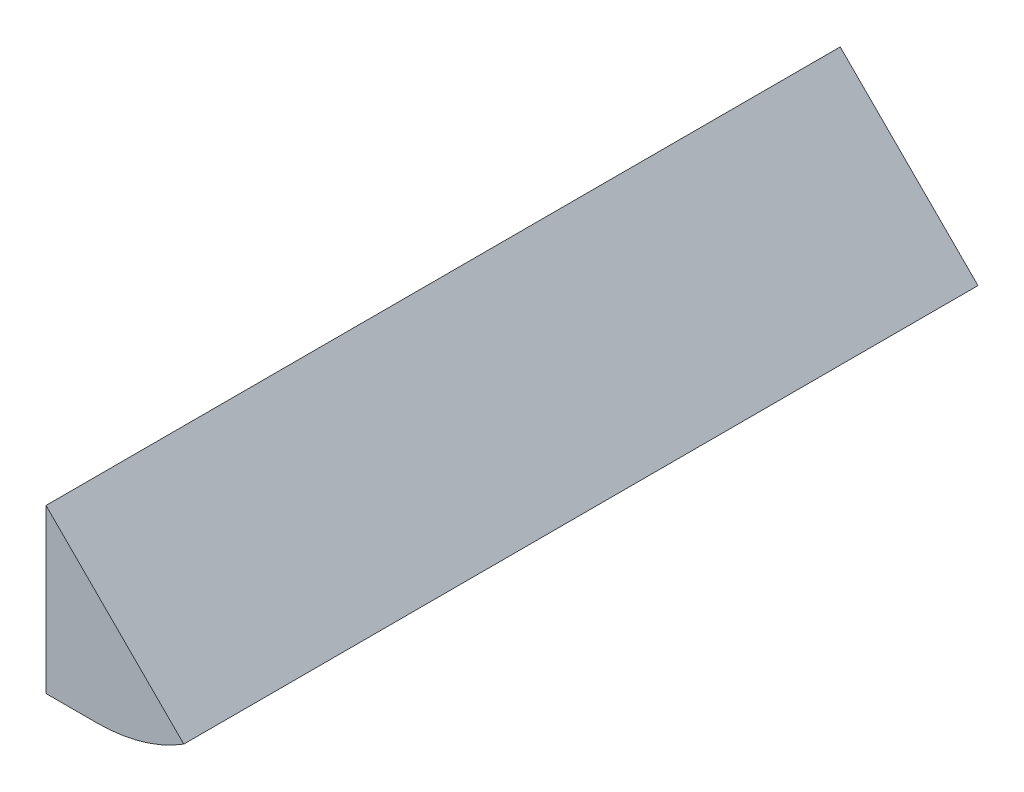
ISO-10303-21;
HEADER;
FILE_DESCRIPTION(('STEP AP214'),'2;1');
FILE_NAME('part.step','',(''),(''),'','','');
FILE_SCHEMA(('AUTOMOTIVE_DESIGN { 1 0 10303 214 1 1 1 1 }'));
ENDSEC;
DATA;
#1=APPLICATION_CONTEXT('core data for automotive mechanical design processes');
#2=APPLICATION_PROTOCOL_DEFINITION('international standard','automotive_design',2000,#1);
#3=PRODUCT_CONTEXT('',#1,'mechanical');
#4=PRODUCT('Part','Part','',(#3));
#5=PRODUCT_RELATED_PRODUCT_CATEGORY('part','',(#4));
#6=PRODUCT_DEFINITION_FORMATION('','',#4);
#7=PRODUCT_DEFINITION_CONTEXT('part definition',#1,'design');
#8=PRODUCT_DEFINITION('design','',#6,#7);
#9=PRODUCT_DEFINITION_SHAPE('','',#8);
#10=(LENGTH_UNIT() NAMED_UNIT(*) SI_UNIT(.MILLI.,.METRE.));
#11=(NAMED_UNIT(*) PLANE_ANGLE_UNIT() SI_UNIT($,.RADIAN.));
#12=(NAMED_UNIT(*) SI_UNIT($,.STERADIAN.) SOLID_ANGLE_UNIT());
#13=UNCERTAINTY_MEASURE_WITH_UNIT(LENGTH_MEASURE(1.E-05),#10,'distance_accuracy_value','');
#14=(GEOMETRIC_REPRESENTATION_CONTEXT(3) GLOBAL_UNCERTAINTY_ASSIGNED_CONTEXT((#13)) GLOBAL_UNIT_ASSIGNED_CONTEXT((#10,
#11,#12)) REPRESENTATION_CONTEXT('',''));
#15=CARTESIAN_POINT('',(0.,0.,0.));
#16=DIRECTION('',(0.,0.,1.));
#17=DIRECTION('',(1.,0.,0.));
#18=AXIS2_PLACEMENT_3D('',#15,#16,#17);
#19=CARTESIAN_POINT('',(-410.,15.9999999999999,-49.9999999999999));
#20=DIRECTION('',(0.707106770426429,0.707106791946666,0.));
#21=DIRECTION('',(-0.707106791946666,0.707106770426429,0.));
#22=AXIS2_PLACEMENT_3D('',#19,#20,#21);
#23=PLANE('',#22);
#24=DIRECTION('',(-0.707106791946666,0.707106770426429,0.));
#25=VECTOR('',#24,1.);
#26=CARTESIAN_POINT('',(-410.,15.9999999999999,-10.9999999999999));
#27=LINE('',#26,#25);
#28=CARTESIAN_POINT('',(-403.232980949843,9.23298115905522,-10.9999999999999));
#29=VERTEX_POINT('',#28);
#30=CARTESIAN_POINT('',(-410.,15.9999999999999,-10.9999999999999));
#31=VERTEX_POINT('',#30);
#32=EDGE_CURVE('E100',#29,#31,#27,.T.);
#33=ORIENTED_EDGE('',*,*,#32,.F.);
#34=DIRECTION('',(0.,0.,1.));
#35=VECTOR('',#34,1.);
#36=CARTESIAN_POINT('',(-403.232980949843,9.23298115905522,-49.9999999999999));
#37=LINE('',#36,#35);
#38=CARTESIAN_POINT('',(-403.232980949843,9.23298115905522,-49.9999999999999));
#39=VERTEX_POINT('',#38);
#40=EDGE_CURVE('E11',#39,#29,#37,.T.);
#41=ORIENTED_EDGE('',*,*,#40,.F.);
#42=DIRECTION('',(-0.707106791946666,0.707106770426429,0.));
#43=VECTOR('',#42,1.);
#44=CARTESIAN_POINT('',(-410.,15.9999999999999,-49.9999999999999));
#45=LINE('',#44,#43);
#46=CARTESIAN_POINT('',(-410.,15.9999999999999,-49.9999999999999));
#47=VERTEX_POINT('',#46);
#48=EDGE_CURVE('E94',#39,#47,#45,.T.);
#49=ORIENTED_EDGE('',*,*,#48,.T.);
#50=DIRECTION('',(0.,0.,1.));
#51=VECTOR('',#50,1.);
#52=CARTESIAN_POINT('',(-410.,15.9999999999999,-49.9999999999999));
#53=LINE('',#52,#51);
#54=EDGE_CURVE('E39',#47,#31,#53,.T.);
#55=ORIENTED_EDGE('',*,*,#54,.T.);
#56=EDGE_LOOP('',(#33,#41,#49,#55));
#57=FACE_BOUND('',#56,.T.);
#58=ADVANCED_FACE('F36',(#57),#23,.T.);
#59=CARTESIAN_POINT('',(-407.5,15.9999997147528,-49.9999999999999));
#60=DIRECTION('',(0.,0.,1.));
#61=DIRECTION('',(1.,0.,0.));
#62=AXIS2_PLACEMENT_3D('',#59,#60,#61);
#63=CYLINDRICAL_SURFACE('',#62,7.99999948172251);
#64=CARTESIAN_POINT('',(-407.5,15.9999997147528,-10.9999999999999));
#65=DIRECTION('',(0.,0.,1.));
#66=DIRECTION('',(1.,0.,0.));
#67=AXIS2_PLACEMENT_3D('',#64,#65,#66);
#68=CIRCLE('',#67,7.99999948172251);
#69=CARTESIAN_POINT('',(-407.5,8.00000024347367,-10.9999999999999));
#70=VERTEX_POINT('',#69);
#71=EDGE_CURVE('E96',#70,#29,#68,.T.);
#72=ORIENTED_EDGE('',*,*,#71,.F.);
#73=DIRECTION('',(0.,0.,1.));
#74=VECTOR('',#73,1.);
#75=CARTESIAN_POINT('',(-407.5,8.00000024347367,-49.9999999999999));
#76=LINE('',#75,#74);
#77=CARTESIAN_POINT('',(-407.5,8.00000024347367,-49.9999999999999));
#78=VERTEX_POINT('',#77);
#79=EDGE_CURVE('E45',#78,#70,#76,.T.);
#80=ORIENTED_EDGE('',*,*,#79,.F.);
#81=CARTESIAN_POINT('',(-407.5,15.9999997147528,-49.9999999999999));
#82=DIRECTION('',(0.,0.,1.));
#83=DIRECTION('',(1.,0.,0.));
#84=AXIS2_PLACEMENT_3D('',#81,#82,#83);
#85=CIRCLE('',#84,7.99999948172251);
#86=EDGE_CURVE('E91',#78,#39,#85,.T.);
#87=ORIENTED_EDGE('',*,*,#86,.T.);
#88=ORIENTED_EDGE('',*,*,#40,.T.);
#89=EDGE_LOOP('',(#72,#80,#87,#88));
#90=FACE_BOUND('',#89,.T.);
#91=ADVANCED_FACE('F110',(#90),#63,.T.);
#92=CARTESIAN_POINT('',(-407.5,8.00000024347367,-49.9999999999999));
#93=DIRECTION('',(9.73895124267769E-08,-0.999999999999995,0.));
#94=DIRECTION('',(0.999999999999995,9.73895124267769E-08,0.));
#95=AXIS2_PLACEMENT_3D('',#92,#93,#94);
#96=PLANE('',#95);
#97=DIRECTION('',(0.999999999999995,9.73895124267769E-08,0.));
#98=VECTOR('',#97,1.);
#99=CARTESIAN_POINT('',(-407.5,8.00000024347367,-10.9999999999999));
#100=LINE('',#99,#98);
#101=CARTESIAN_POINT('',(-410.,7.99999999999989,-10.9999999999999));
#102=VERTEX_POINT('',#101);
#103=EDGE_CURVE('E86',#102,#70,#100,.T.);
#104=ORIENTED_EDGE('',*,*,#103,.F.);
#105=DIRECTION('',(0.,0.,1.));
#106=VECTOR('',#105,1.);
#107=CARTESIAN_POINT('',(-410.,7.99999999999989,-49.9999999999999));
#108=LINE('',#107,#106);
#109=CARTESIAN_POINT('',(-410.,7.99999999999989,-49.9999999999999));
#110=VERTEX_POINT('',#109);
#111=EDGE_CURVE('E81',#110,#102,#108,.T.);
#112=ORIENTED_EDGE('',*,*,#111,.F.);
#113=DIRECTION('',(0.999999999999995,9.73895124267769E-08,0.));
#114=VECTOR('',#113,1.);
#115=CARTESIAN_POINT('',(-407.5,8.00000024347367,-49.9999999999999));
#116=LINE('',#115,#114);
#117=EDGE_CURVE('E84',#110,#78,#116,.T.);
#118=ORIENTED_EDGE('',*,*,#117,.T.);
#119=ORIENTED_EDGE('',*,*,#79,.T.);
#120=EDGE_LOOP('',(#104,#112,#118,#119));
#121=FACE_BOUND('',#120,.T.);
#122=ADVANCED_FACE('F83',(#121),#96,.T.);
#123=CARTESIAN_POINT('',(-410.,15.9999999999999,-49.9999999999999));
#124=DIRECTION('',(-1.,0.,0.));
#125=DIRECTION('',(0.,0.,1.));
#126=AXIS2_PLACEMENT_3D('',#123,#124,#125);
#127=PLANE('',#126);
#128=DIRECTION('',(0.,-1.,0.));
#129=VECTOR('',#128,1.);
#130=CARTESIAN_POINT('',(-410.,15.9999999999999,-10.9999999999999));
#131=LINE('',#130,#129);
#132=EDGE_CURVE('E103',#31,#102,#131,.T.);
#133=ORIENTED_EDGE('',*,*,#132,.F.);
#134=ORIENTED_EDGE('',*,*,#54,.F.);
#135=DIRECTION('',(0.,-1.,0.));
#136=VECTOR('',#135,1.);
#137=CARTESIAN_POINT('',(-410.,15.9999999999999,-49.9999999999999));
#138=LINE('',#137,#136);
#139=EDGE_CURVE('E90',#47,#110,#138,.T.);
#140=ORIENTED_EDGE('',*,*,#139,.T.);
#141=ORIENTED_EDGE('',*,*,#111,.T.);
#142=EDGE_LOOP('',(#133,#134,#140,#141));
#143=FACE_BOUND('',#142,.T.);
#144=ADVANCED_FACE('F93',(#143),#127,.T.);
#145=CARTESIAN_POINT('',(-407.5,15.9999997147528,-49.9999999999999));
#146=DIRECTION('',(0.,0.,1.));
#147=DIRECTION('',(1.,0.,0.));
#148=AXIS2_PLACEMENT_3D('',#145,#146,#147);
#149=PLANE('',#148);
#150=ORIENTED_EDGE('',*,*,#48,.F.);
#151=ORIENTED_EDGE('',*,*,#86,.F.);
#152=ORIENTED_EDGE('',*,*,#117,.F.);
#153=ORIENTED_EDGE('',*,*,#139,.F.);
#154=EDGE_LOOP('',(#150,#151,#152,#153));
#155=FACE_BOUND('',#154,.T.);
#156=ADVANCED_FACE('F89',(#155),#149,.F.);
#157=CARTESIAN_POINT('',(-407.5,15.9999997147528,-10.9999999999999));
#158=DIRECTION('',(0.,0.,1.));
#159=DIRECTION('',(1.,0.,0.));
#160=AXIS2_PLACEMENT_3D('',#157,#158,#159);
#161=PLANE('',#160);
#162=ORIENTED_EDGE('',*,*,#32,.T.);
#163=ORIENTED_EDGE('',*,*,#132,.T.);
#164=ORIENTED_EDGE('',*,*,#103,.T.);
#165=ORIENTED_EDGE('',*,*,#71,.T.);
#166=EDGE_LOOP('',(#162,#163,#164,#165));
#167=FACE_BOUND('',#166,.T.);
#168=ADVANCED_FACE('F109',(#167),#161,.T.);
#169=CLOSED_SHELL('',(#58,#91,#122,#144,#156,#168));
#170=MANIFOLD_SOLID_BREP('B2',#169);
#171=ADVANCED_BREP_SHAPE_REPRESENTATION('',(#18,#170),#14);
#172=SHAPE_DEFINITION_REPRESENTATION(#9,#171);
ENDSEC;
END-ISO-10303-21;
